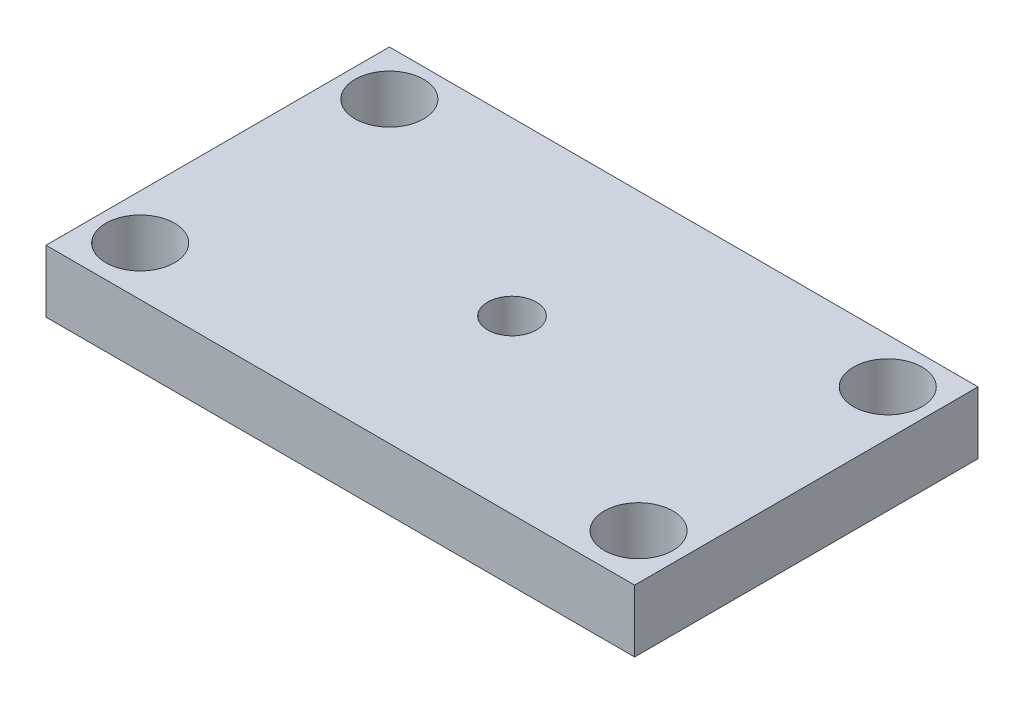
ISO-10303-21;
HEADER;
FILE_DESCRIPTION(('STEP AP214'),'2;1');
FILE_NAME('part.step','',(''),(''),'','','');
FILE_SCHEMA(('AUTOMOTIVE_DESIGN { 1 0 10303 214 1 1 1 1 }'));
ENDSEC;
DATA;
#1=APPLICATION_CONTEXT('core data for automotive mechanical design processes');
#2=APPLICATION_PROTOCOL_DEFINITION('international standard','automotive_design',2000,#1);
#3=PRODUCT_CONTEXT('',#1,'mechanical');
#4=PRODUCT('Part','Part','',(#3));
#5=PRODUCT_RELATED_PRODUCT_CATEGORY('part','',(#4));
#6=PRODUCT_DEFINITION_FORMATION('','',#4);
#7=PRODUCT_DEFINITION_CONTEXT('part definition',#1,'design');
#8=PRODUCT_DEFINITION('design','',#6,#7);
#9=PRODUCT_DEFINITION_SHAPE('','',#8);
#10=(LENGTH_UNIT() NAMED_UNIT(*) SI_UNIT(.MILLI.,.METRE.));
#11=(NAMED_UNIT(*) PLANE_ANGLE_UNIT() SI_UNIT($,.RADIAN.));
#12=(NAMED_UNIT(*) SI_UNIT($,.STERADIAN.) SOLID_ANGLE_UNIT());
#13=UNCERTAINTY_MEASURE_WITH_UNIT(LENGTH_MEASURE(1.E-05),#10,'distance_accuracy_value','');
#14=(GEOMETRIC_REPRESENTATION_CONTEXT(3) GLOBAL_UNCERTAINTY_ASSIGNED_CONTEXT((#13)) GLOBAL_UNIT_ASSIGNED_CONTEXT((#10,
#11,#12)) REPRESENTATION_CONTEXT('',''));
#15=CARTESIAN_POINT('',(0.,0.,0.));
#16=DIRECTION('',(0.,0.,1.));
#17=DIRECTION('',(1.,0.,0.));
#18=AXIS2_PLACEMENT_3D('',#15,#16,#17);
#19=CARTESIAN_POINT('',(0.,6.35,0.));
#20=DIRECTION('',(0.,-1.,0.));
#21=DIRECTION('',(0.,0.,-1.));
#22=AXIS2_PLACEMENT_3D('',#19,#20,#21);
#23=PLANE('',#22);
#24=DIRECTION('',(0.,0.,1.));
#25=VECTOR('',#24,1.);
#26=CARTESIAN_POINT('',(0.,6.35,0.));
#27=LINE('',#26,#25);
#28=CARTESIAN_POINT('',(0.,6.35,-35.));
#29=VERTEX_POINT('',#28);
#30=CARTESIAN_POINT('',(0.,6.35,0.));
#31=VERTEX_POINT('',#30);
#32=EDGE_CURVE('E96',#29,#31,#27,.T.);
#33=ORIENTED_EDGE('',*,*,#32,.T.);
#34=DIRECTION('',(1.,0.,0.));
#35=VECTOR('',#34,1.);
#36=CARTESIAN_POINT('',(0.,6.35,0.));
#37=LINE('',#36,#35);
#38=CARTESIAN_POINT('',(60.,6.35,0.));
#39=VERTEX_POINT('',#38);
#40=EDGE_CURVE('E91',#31,#39,#37,.T.);
#41=ORIENTED_EDGE('',*,*,#40,.T.);
#42=DIRECTION('',(0.,0.,-1.));
#43=VECTOR('',#42,1.);
#44=CARTESIAN_POINT('',(60.,6.35,0.));
#45=LINE('',#44,#43);
#46=CARTESIAN_POINT('',(60.,6.35,-35.));
#47=VERTEX_POINT('',#46);
#48=EDGE_CURVE('E94',#39,#47,#45,.T.);
#49=ORIENTED_EDGE('',*,*,#48,.T.);
#50=DIRECTION('',(-1.,0.,0.));
#51=VECTOR('',#50,1.);
#52=CARTESIAN_POINT('',(0.,6.35,-35.));
#53=LINE('',#52,#51);
#54=EDGE_CURVE('E61',#47,#29,#53,.T.);
#55=ORIENTED_EDGE('',*,*,#54,.T.);
#56=EDGE_LOOP('',(#33,#41,#49,#55));
#57=FACE_BOUND('',#56,.T.);
#58=CARTESIAN_POINT('',(4.6,6.35,-30.4));
#59=DIRECTION('',(0.,1.,0.));
#60=DIRECTION('',(0.,0.,1.));
#61=AXIS2_PLACEMENT_3D('',#58,#59,#60);
#62=CIRCLE('',#61,3.5);
#63=CARTESIAN_POINT('',(4.6,6.35,-26.9));
#64=VERTEX_POINT('',#63);
#65=EDGE_CURVE('E116',#64,#64,#62,.T.);
#66=ORIENTED_EDGE('',*,*,#65,.F.);
#67=EDGE_LOOP('',(#66));
#68=FACE_BOUND('',#67,.T.);
#69=CARTESIAN_POINT('',(55.4,6.35,-30.4));
#70=DIRECTION('',(0.,1.,0.));
#71=DIRECTION('',(0.,0.,1.));
#72=AXIS2_PLACEMENT_3D('',#69,#70,#71);
#73=CIRCLE('',#72,3.5);
#74=CARTESIAN_POINT('',(55.4,6.35,-26.9));
#75=VERTEX_POINT('',#74);
#76=EDGE_CURVE('E138',#75,#75,#73,.T.);
#77=ORIENTED_EDGE('',*,*,#76,.F.);
#78=EDGE_LOOP('',(#77));
#79=FACE_BOUND('',#78,.T.);
#80=CARTESIAN_POINT('',(4.6,6.35,-5.));
#81=DIRECTION('',(0.,1.,0.));
#82=DIRECTION('',(0.,0.,1.));
#83=AXIS2_PLACEMENT_3D('',#80,#81,#82);
#84=CIRCLE('',#83,3.5);
#85=CARTESIAN_POINT('',(4.6,6.35,-1.5));
#86=VERTEX_POINT('',#85);
#87=EDGE_CURVE('E146',#86,#86,#84,.T.);
#88=ORIENTED_EDGE('',*,*,#87,.F.);
#89=EDGE_LOOP('',(#88));
#90=FACE_BOUND('',#89,.T.);
#91=CARTESIAN_POINT('',(55.4,6.35,-5.));
#92=DIRECTION('',(0.,1.,0.));
#93=DIRECTION('',(0.,0.,1.));
#94=AXIS2_PLACEMENT_3D('',#91,#92,#93);
#95=CIRCLE('',#94,3.5);
#96=CARTESIAN_POINT('',(55.4,6.35,-1.5));
#97=VERTEX_POINT('',#96);
#98=EDGE_CURVE('E154',#97,#97,#95,.T.);
#99=ORIENTED_EDGE('',*,*,#98,.F.);
#100=EDGE_LOOP('',(#99));
#101=FACE_BOUND('',#100,.T.);
#102=CARTESIAN_POINT('',(30.,6.35,-17.5));
#103=DIRECTION('',(0.,1.,0.));
#104=DIRECTION('',(0.,0.,1.));
#105=AXIS2_PLACEMENT_3D('',#102,#103,#104);
#106=CIRCLE('',#105,2.475);
#107=CARTESIAN_POINT('',(30.,6.35,-15.025));
#108=VERTEX_POINT('',#107);
#109=EDGE_CURVE('E162',#108,#108,#106,.T.);
#110=ORIENTED_EDGE('',*,*,#109,.F.);
#111=EDGE_LOOP('',(#110));
#112=FACE_BOUND('',#111,.T.);
#113=ADVANCED_FACE('F43',(#57,#68,#79,#90,#101,#112),#23,.F.);
#114=CARTESIAN_POINT('',(0.,0.,0.));
#115=DIRECTION('',(0.,-1.,0.));
#116=DIRECTION('',(0.,0.,-1.));
#117=AXIS2_PLACEMENT_3D('',#114,#115,#116);
#118=PLANE('',#117);
#119=CARTESIAN_POINT('',(55.4,0.,-5.));
#120=DIRECTION('',(0.,1.,0.));
#121=DIRECTION('',(0.,0.,1.));
#122=AXIS2_PLACEMENT_3D('',#119,#120,#121);
#123=CIRCLE('',#122,3.5);
#124=CARTESIAN_POINT('',(55.4,0.,-1.5));
#125=VERTEX_POINT('',#124);
#126=EDGE_CURVE('E158',#125,#125,#123,.T.);
#127=ORIENTED_EDGE('',*,*,#126,.T.);
#128=EDGE_LOOP('',(#127));
#129=FACE_BOUND('',#128,.T.);
#130=CARTESIAN_POINT('',(55.4,0.,-30.4));
#131=DIRECTION('',(0.,1.,0.));
#132=DIRECTION('',(0.,0.,1.));
#133=AXIS2_PLACEMENT_3D('',#130,#131,#132);
#134=CIRCLE('',#133,3.5);
#135=CARTESIAN_POINT('',(55.4,0.,-26.9));
#136=VERTEX_POINT('',#135);
#137=EDGE_CURVE('E142',#136,#136,#134,.T.);
#138=ORIENTED_EDGE('',*,*,#137,.T.);
#139=EDGE_LOOP('',(#138));
#140=FACE_BOUND('',#139,.T.);
#141=DIRECTION('',(0.,0.,1.));
#142=VECTOR('',#141,1.);
#143=CARTESIAN_POINT('',(0.,0.,0.));
#144=LINE('',#143,#142);
#145=CARTESIAN_POINT('',(0.,0.,-35.));
#146=VERTEX_POINT('',#145);
#147=CARTESIAN_POINT('',(0.,0.,0.));
#148=VERTEX_POINT('',#147);
#149=EDGE_CURVE('E112',#146,#148,#144,.T.);
#150=ORIENTED_EDGE('',*,*,#149,.F.);
#151=DIRECTION('',(-1.,0.,0.));
#152=VECTOR('',#151,1.);
#153=CARTESIAN_POINT('',(0.,0.,-35.));
#154=LINE('',#153,#152);
#155=CARTESIAN_POINT('',(60.,0.,-35.));
#156=VERTEX_POINT('',#155);
#157=EDGE_CURVE('E84',#156,#146,#154,.T.);
#158=ORIENTED_EDGE('',*,*,#157,.F.);
#159=DIRECTION('',(0.,0.,-1.));
#160=VECTOR('',#159,1.);
#161=CARTESIAN_POINT('',(60.,0.,0.));
#162=LINE('',#161,#160);
#163=CARTESIAN_POINT('',(60.,0.,0.));
#164=VERTEX_POINT('',#163);
#165=EDGE_CURVE('E78',#164,#156,#162,.T.);
#166=ORIENTED_EDGE('',*,*,#165,.F.);
#167=DIRECTION('',(1.,0.,0.));
#168=VECTOR('',#167,1.);
#169=CARTESIAN_POINT('',(0.,0.,0.));
#170=LINE('',#169,#168);
#171=EDGE_CURVE('E101',#148,#164,#170,.T.);
#172=ORIENTED_EDGE('',*,*,#171,.F.);
#173=EDGE_LOOP('',(#150,#158,#166,#172));
#174=FACE_BOUND('',#173,.T.);
#175=CARTESIAN_POINT('',(4.6,0.,-30.4));
#176=DIRECTION('',(0.,1.,0.));
#177=DIRECTION('',(0.,0.,1.));
#178=AXIS2_PLACEMENT_3D('',#175,#176,#177);
#179=CIRCLE('',#178,3.5);
#180=CARTESIAN_POINT('',(4.6,0.,-26.9));
#181=VERTEX_POINT('',#180);
#182=EDGE_CURVE('E134',#181,#181,#179,.T.);
#183=ORIENTED_EDGE('',*,*,#182,.T.);
#184=EDGE_LOOP('',(#183));
#185=FACE_BOUND('',#184,.T.);
#186=CARTESIAN_POINT('',(4.6,0.,-5.));
#187=DIRECTION('',(0.,1.,0.));
#188=DIRECTION('',(0.,0.,1.));
#189=AXIS2_PLACEMENT_3D('',#186,#187,#188);
#190=CIRCLE('',#189,3.5);
#191=CARTESIAN_POINT('',(4.6,0.,-1.5));
#192=VERTEX_POINT('',#191);
#193=EDGE_CURVE('E150',#192,#192,#190,.T.);
#194=ORIENTED_EDGE('',*,*,#193,.T.);
#195=EDGE_LOOP('',(#194));
#196=FACE_BOUND('',#195,.T.);
#197=CARTESIAN_POINT('',(30.,0.,-17.5));
#198=DIRECTION('',(0.,1.,0.));
#199=DIRECTION('',(0.,0.,1.));
#200=AXIS2_PLACEMENT_3D('',#197,#198,#199);
#201=CIRCLE('',#200,2.475);
#202=CARTESIAN_POINT('',(30.,0.,-15.025));
#203=VERTEX_POINT('',#202);
#204=EDGE_CURVE('E166',#203,#203,#201,.T.);
#205=ORIENTED_EDGE('',*,*,#204,.T.);
#206=EDGE_LOOP('',(#205));
#207=FACE_BOUND('',#206,.T.);
#208=ADVANCED_FACE('F129',(#129,#140,#174,#185,#196,#207),#118,.T.);
#209=CARTESIAN_POINT('',(0.,6.35,0.));
#210=DIRECTION('',(1.,0.,0.));
#211=DIRECTION('',(0.,0.,-1.));
#212=AXIS2_PLACEMENT_3D('',#209,#210,#211);
#213=PLANE('',#212);
#214=ORIENTED_EDGE('',*,*,#149,.T.);
#215=DIRECTION('',(0.,-1.,0.));
#216=VECTOR('',#215,1.);
#217=CARTESIAN_POINT('',(0.,6.35,0.));
#218=LINE('',#217,#216);
#219=EDGE_CURVE('E11',#31,#148,#218,.T.);
#220=ORIENTED_EDGE('',*,*,#219,.F.);
#221=ORIENTED_EDGE('',*,*,#32,.F.);
#222=DIRECTION('',(0.,-1.,0.));
#223=VECTOR('',#222,1.);
#224=CARTESIAN_POINT('',(0.,6.35,-35.));
#225=LINE('',#224,#223);
#226=EDGE_CURVE('E108',#29,#146,#225,.T.);
#227=ORIENTED_EDGE('',*,*,#226,.T.);
#228=EDGE_LOOP('',(#214,#220,#221,#227));
#229=FACE_BOUND('',#228,.T.);
#230=ADVANCED_FACE('F45',(#229),#213,.F.);
#231=CARTESIAN_POINT('',(0.,6.35,0.));
#232=DIRECTION('',(0.,0.,-1.));
#233=DIRECTION('',(-1.,0.,0.));
#234=AXIS2_PLACEMENT_3D('',#231,#232,#233);
#235=PLANE('',#234);
#236=ORIENTED_EDGE('',*,*,#171,.T.);
#237=DIRECTION('',(0.,-1.,0.));
#238=VECTOR('',#237,1.);
#239=CARTESIAN_POINT('',(60.,6.35,0.));
#240=LINE('',#239,#238);
#241=EDGE_CURVE('E53',#39,#164,#240,.T.);
#242=ORIENTED_EDGE('',*,*,#241,.F.);
#243=ORIENTED_EDGE('',*,*,#40,.F.);
#244=ORIENTED_EDGE('',*,*,#219,.T.);
#245=EDGE_LOOP('',(#236,#242,#243,#244));
#246=FACE_BOUND('',#245,.T.);
#247=ADVANCED_FACE('F100',(#246),#235,.F.);
#248=CARTESIAN_POINT('',(60.,6.35,0.));
#249=DIRECTION('',(-1.,0.,0.));
#250=DIRECTION('',(0.,0.,1.));
#251=AXIS2_PLACEMENT_3D('',#248,#249,#250);
#252=PLANE('',#251);
#253=ORIENTED_EDGE('',*,*,#165,.T.);
#254=DIRECTION('',(0.,-1.,0.));
#255=VECTOR('',#254,1.);
#256=CARTESIAN_POINT('',(60.,6.35,-35.));
#257=LINE('',#256,#255);
#258=EDGE_CURVE('E103',#47,#156,#257,.T.);
#259=ORIENTED_EDGE('',*,*,#258,.F.);
#260=ORIENTED_EDGE('',*,*,#48,.F.);
#261=ORIENTED_EDGE('',*,*,#241,.T.);
#262=EDGE_LOOP('',(#253,#259,#260,#261));
#263=FACE_BOUND('',#262,.T.);
#264=ADVANCED_FACE('F104',(#263),#252,.F.);
#265=CARTESIAN_POINT('',(0.,6.35,-35.));
#266=DIRECTION('',(0.,0.,1.));
#267=DIRECTION('',(1.,0.,0.));
#268=AXIS2_PLACEMENT_3D('',#265,#266,#267);
#269=PLANE('',#268);
#270=ORIENTED_EDGE('',*,*,#157,.T.);
#271=ORIENTED_EDGE('',*,*,#226,.F.);
#272=ORIENTED_EDGE('',*,*,#54,.F.);
#273=ORIENTED_EDGE('',*,*,#258,.T.);
#274=EDGE_LOOP('',(#270,#271,#272,#273));
#275=FACE_BOUND('',#274,.T.);
#276=ADVANCED_FACE('F126',(#275),#269,.F.);
#277=CARTESIAN_POINT('',(4.6,6.35,-30.4));
#278=DIRECTION('',(0.,-1.,0.));
#279=DIRECTION('',(0.,0.,-1.));
#280=AXIS2_PLACEMENT_3D('',#277,#278,#279);
#281=CYLINDRICAL_SURFACE('',#280,3.5);
#282=ORIENTED_EDGE('',*,*,#65,.T.);
#283=EDGE_LOOP('',(#282));
#284=FACE_BOUND('',#283,.T.);
#285=ORIENTED_EDGE('',*,*,#182,.F.);
#286=EDGE_LOOP('',(#285));
#287=FACE_BOUND('',#286,.T.);
#288=ADVANCED_FACE('F185',(#284,#287),#281,.F.);
#289=CARTESIAN_POINT('',(55.4,6.35,-30.4));
#290=DIRECTION('',(0.,-1.,0.));
#291=DIRECTION('',(0.,0.,-1.));
#292=AXIS2_PLACEMENT_3D('',#289,#290,#291);
#293=CYLINDRICAL_SURFACE('',#292,3.5);
#294=ORIENTED_EDGE('',*,*,#76,.T.);
#295=EDGE_LOOP('',(#294));
#296=FACE_BOUND('',#295,.T.);
#297=ORIENTED_EDGE('',*,*,#137,.F.);
#298=EDGE_LOOP('',(#297));
#299=FACE_BOUND('',#298,.T.);
#300=ADVANCED_FACE('F239',(#296,#299),#293,.F.);
#301=CARTESIAN_POINT('',(4.6,6.35,-5.));
#302=DIRECTION('',(0.,-1.,0.));
#303=DIRECTION('',(0.,0.,-1.));
#304=AXIS2_PLACEMENT_3D('',#301,#302,#303);
#305=CYLINDRICAL_SURFACE('',#304,3.5);
#306=ORIENTED_EDGE('',*,*,#87,.T.);
#307=EDGE_LOOP('',(#306));
#308=FACE_BOUND('',#307,.T.);
#309=ORIENTED_EDGE('',*,*,#193,.F.);
#310=EDGE_LOOP('',(#309));
#311=FACE_BOUND('',#310,.T.);
#312=ADVANCED_FACE('F248',(#308,#311),#305,.F.);
#313=CARTESIAN_POINT('',(55.4,6.35,-5.));
#314=DIRECTION('',(0.,-1.,0.));
#315=DIRECTION('',(0.,0.,-1.));
#316=AXIS2_PLACEMENT_3D('',#313,#314,#315);
#317=CYLINDRICAL_SURFACE('',#316,3.5);
#318=ORIENTED_EDGE('',*,*,#98,.T.);
#319=EDGE_LOOP('',(#318));
#320=FACE_BOUND('',#319,.T.);
#321=ORIENTED_EDGE('',*,*,#126,.F.);
#322=EDGE_LOOP('',(#321));
#323=FACE_BOUND('',#322,.T.);
#324=ADVANCED_FACE('F257',(#320,#323),#317,.F.);
#325=CARTESIAN_POINT('',(30.,6.35,-17.5));
#326=DIRECTION('',(0.,-1.,0.));
#327=DIRECTION('',(0.,0.,-1.));
#328=AXIS2_PLACEMENT_3D('',#325,#326,#327);
#329=CYLINDRICAL_SURFACE('',#328,2.475);
#330=ORIENTED_EDGE('',*,*,#109,.T.);
#331=EDGE_LOOP('',(#330));
#332=FACE_BOUND('',#331,.T.);
#333=ORIENTED_EDGE('',*,*,#204,.F.);
#334=EDGE_LOOP('',(#333));
#335=FACE_BOUND('',#334,.T.);
#336=ADVANCED_FACE('F174',(#332,#335),#329,.F.);
#337=CLOSED_SHELL('',(#113,#208,#230,#247,#264,#276,#288,#300,#312,#324,#336));
#338=MANIFOLD_SOLID_BREP('B2',#337);
#339=ADVANCED_BREP_SHAPE_REPRESENTATION('',(#18,#338),#14);
#340=SHAPE_DEFINITION_REPRESENTATION(#9,#339);
ENDSEC;
END-ISO-10303-21;
